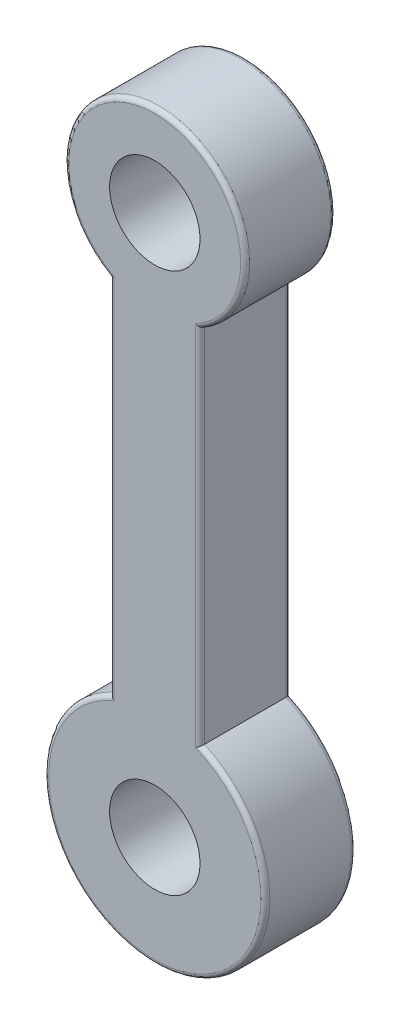
ISO-10303-21;
HEADER;
FILE_DESCRIPTION(('STEP AP214'),'2;1');
FILE_NAME('part.step','',(''),(''),'','','');
FILE_SCHEMA(('AUTOMOTIVE_DESIGN { 1 0 10303 214 1 1 1 1 }'));
ENDSEC;
DATA;
#1=APPLICATION_CONTEXT('core data for automotive mechanical design processes');
#2=APPLICATION_PROTOCOL_DEFINITION('international standard','automotive_design',2000,#1);
#3=PRODUCT_CONTEXT('',#1,'mechanical');
#4=PRODUCT('Part','Part','',(#3));
#5=PRODUCT_RELATED_PRODUCT_CATEGORY('part','',(#4));
#6=PRODUCT_DEFINITION_FORMATION('','',#4);
#7=PRODUCT_DEFINITION_CONTEXT('part definition',#1,'design');
#8=PRODUCT_DEFINITION('design','',#6,#7);
#9=PRODUCT_DEFINITION_SHAPE('','',#8);
#10=(LENGTH_UNIT() NAMED_UNIT(*) SI_UNIT(.MILLI.,.METRE.));
#11=(NAMED_UNIT(*) PLANE_ANGLE_UNIT() SI_UNIT($,.RADIAN.));
#12=(NAMED_UNIT(*) SI_UNIT($,.STERADIAN.) SOLID_ANGLE_UNIT());
#13=UNCERTAINTY_MEASURE_WITH_UNIT(LENGTH_MEASURE(1.E-05),#10,'distance_accuracy_value','');
#14=(GEOMETRIC_REPRESENTATION_CONTEXT(3) GLOBAL_UNCERTAINTY_ASSIGNED_CONTEXT((#13)) GLOBAL_UNIT_ASSIGNED_CONTEXT((#10,
#11,#12)) REPRESENTATION_CONTEXT('',''));
#15=CARTESIAN_POINT('',(0.,0.,0.));
#16=DIRECTION('',(0.,0.,1.));
#17=DIRECTION('',(1.,0.,0.));
#18=AXIS2_PLACEMENT_3D('',#15,#16,#17);
#19=CARTESIAN_POINT('',(0.,0.,20.));
#20=DIRECTION('',(0.,0.,1.));
#21=DIRECTION('',(1.,0.,0.));
#22=AXIS2_PLACEMENT_3D('',#19,#20,#21);
#23=PLANE('',#22);
#24=DIRECTION('',(0.,-1.,0.));
#25=VECTOR('',#24,1.);
#26=CARTESIAN_POINT('',(-9.,-97.3205080756888,20.));
#27=LINE('',#26,#25);
#28=CARTESIAN_POINT('',(-9.,-16.7332005306815,20.));
#29=VERTEX_POINT('',#28);
#30=CARTESIAN_POINT('',(-9.,-97.9779457767185,20.));
#31=VERTEX_POINT('',#30);
#32=EDGE_CURVE('E132',#29,#31,#27,.T.);
#33=ORIENTED_EDGE('',*,*,#32,.T.);
#34=CARTESIAN_POINT('',(0.,-119.641016151378,20.));
#35=DIRECTION('',(0.,0.,1.));
#36=DIRECTION('',(1.,0.,0.));
#37=AXIS2_PLACEMENT_3D('',#34,#35,#36);
#38=CIRCLE('',#37,23.4582313497294);
#39=CARTESIAN_POINT('',(9.,-97.9779457767185,20.));
#40=VERTEX_POINT('',#39);
#41=EDGE_CURVE('E113',#31,#40,#38,.T.);
#42=ORIENTED_EDGE('',*,*,#41,.T.);
#43=DIRECTION('',(0.,1.,0.));
#44=VECTOR('',#43,1.);
#45=CARTESIAN_POINT('',(9.,-17.3205080756888,20.));
#46=LINE('',#45,#44);
#47=CARTESIAN_POINT('',(9.,-16.7332005306815,20.));
#48=VERTEX_POINT('',#47);
#49=EDGE_CURVE('E121',#40,#48,#46,.T.);
#50=ORIENTED_EDGE('',*,*,#49,.T.);
#51=CARTESIAN_POINT('',(0.,0.,20.));
#52=DIRECTION('',(0.,0.,1.));
#53=DIRECTION('',(1.,0.,0.));
#54=AXIS2_PLACEMENT_3D('',#51,#52,#53);
#55=CIRCLE('',#54,19.);
#56=EDGE_CURVE('E127',#48,#29,#55,.T.);
#57=ORIENTED_EDGE('',*,*,#56,.T.);
#58=EDGE_LOOP('',(#33,#42,#50,#57));
#59=FACE_BOUND('',#58,.T.);
#60=CARTESIAN_POINT('',(0.,0.,20.));
#61=DIRECTION('',(0.,0.,1.));
#62=DIRECTION('',(1.,0.,0.));
#63=AXIS2_PLACEMENT_3D('',#60,#61,#62);
#64=CIRCLE('',#63,10.);
#65=CARTESIAN_POINT('',(10.,0.,20.));
#66=VERTEX_POINT('',#65);
#67=EDGE_CURVE('E249',#66,#66,#64,.T.);
#68=ORIENTED_EDGE('',*,*,#67,.F.);
#69=EDGE_LOOP('',(#68));
#70=FACE_BOUND('',#69,.T.);
#71=CARTESIAN_POINT('',(0.,-119.641016151378,20.));
#72=DIRECTION('',(0.,0.,1.));
#73=DIRECTION('',(1.,0.,0.));
#74=AXIS2_PLACEMENT_3D('',#71,#72,#73);
#75=CIRCLE('',#74,10.);
#76=CARTESIAN_POINT('',(10.,-119.641016151378,20.));
#77=VERTEX_POINT('',#76);
#78=EDGE_CURVE('E299',#77,#77,#75,.T.);
#79=ORIENTED_EDGE('',*,*,#78,.F.);
#80=EDGE_LOOP('',(#79));
#81=FACE_BOUND('',#80,.T.);
#82=ADVANCED_FACE('F36',(#59,#70,#81),#23,.T.);
#83=CARTESIAN_POINT('',(0.,0.,0.));
#84=DIRECTION('',(0.,0.,1.));
#85=DIRECTION('',(1.,0.,0.));
#86=AXIS2_PLACEMENT_3D('',#83,#84,#85);
#87=PLANE('',#86);
#88=CARTESIAN_POINT('',(0.,0.,0.));
#89=DIRECTION('',(0.,0.,1.));
#90=DIRECTION('',(1.,0.,0.));
#91=AXIS2_PLACEMENT_3D('',#88,#89,#90);
#92=CIRCLE('',#91,19.);
#93=CARTESIAN_POINT('',(-9.,-16.7332005306815,0.));
#94=VERTEX_POINT('',#93);
#95=CARTESIAN_POINT('',(9.,-16.7332005306815,0.));
#96=VERTEX_POINT('',#95);
#97=EDGE_CURVE('E154',#94,#96,#92,.F.);
#98=ORIENTED_EDGE('',*,*,#97,.T.);
#99=DIRECTION('',(0.,1.,0.));
#100=VECTOR('',#99,1.);
#101=CARTESIAN_POINT('',(9.,0.,0.));
#102=LINE('',#101,#100);
#103=CARTESIAN_POINT('',(9.,-97.9779457767185,0.));
#104=VERTEX_POINT('',#103);
#105=EDGE_CURVE('E11',#96,#104,#102,.F.);
#106=ORIENTED_EDGE('',*,*,#105,.T.);
#107=CARTESIAN_POINT('',(0.,-119.641016151378,0.));
#108=DIRECTION('',(0.,0.,1.));
#109=DIRECTION('',(1.,0.,0.));
#110=AXIS2_PLACEMENT_3D('',#107,#108,#109);
#111=CIRCLE('',#110,23.4582313497294);
#112=CARTESIAN_POINT('',(-9.,-97.9779457767185,0.));
#113=VERTEX_POINT('',#112);
#114=EDGE_CURVE('E50',#104,#113,#111,.F.);
#115=ORIENTED_EDGE('',*,*,#114,.T.);
#116=DIRECTION('',(0.,-1.,0.));
#117=VECTOR('',#116,1.);
#118=CARTESIAN_POINT('',(-9.,0.,0.));
#119=LINE('',#118,#117);
#120=EDGE_CURVE('E156',#113,#94,#119,.F.);
#121=ORIENTED_EDGE('',*,*,#120,.T.);
#122=EDGE_LOOP('',(#98,#106,#115,#121));
#123=FACE_BOUND('',#122,.T.);
#124=CARTESIAN_POINT('',(0.,0.,0.));
#125=DIRECTION('',(0.,0.,1.));
#126=DIRECTION('',(1.,0.,0.));
#127=AXIS2_PLACEMENT_3D('',#124,#125,#126);
#128=CIRCLE('',#127,10.);
#129=CARTESIAN_POINT('',(10.,0.,0.));
#130=VERTEX_POINT('',#129);
#131=EDGE_CURVE('E254',#130,#130,#128,.T.);
#132=ORIENTED_EDGE('',*,*,#131,.T.);
#133=EDGE_LOOP('',(#132));
#134=FACE_BOUND('',#133,.T.);
#135=CARTESIAN_POINT('',(0.,-119.641016151378,0.));
#136=DIRECTION('',(0.,0.,1.));
#137=DIRECTION('',(1.,0.,0.));
#138=AXIS2_PLACEMENT_3D('',#135,#136,#137);
#139=CIRCLE('',#138,10.);
#140=CARTESIAN_POINT('',(10.,-119.641016151378,0.));
#141=VERTEX_POINT('',#140);
#142=EDGE_CURVE('E193',#141,#141,#139,.T.);
#143=ORIENTED_EDGE('',*,*,#142,.T.);
#144=EDGE_LOOP('',(#143));
#145=FACE_BOUND('',#144,.T.);
#146=ADVANCED_FACE('F233',(#123,#134,#145),#87,.F.);
#147=CARTESIAN_POINT('',(0.,0.,20.));
#148=DIRECTION('',(0.,0.,-1.));
#149=DIRECTION('',(-1.,0.,0.));
#150=AXIS2_PLACEMENT_3D('',#147,#148,#149);
#151=CYLINDRICAL_SURFACE('',#150,20.);
#152=DIRECTION('',(0.,0.,-1.));
#153=VECTOR('',#152,1.);
#154=CARTESIAN_POINT('',(-10.,-17.3205080756888,20.));
#155=LINE('',#154,#153);
#156=CARTESIAN_POINT('',(-10.,-17.3205080756888,19.));
#157=VERTEX_POINT('',#156);
#158=CARTESIAN_POINT('',(-10.,-17.3205080756888,0.999999999999997));
#159=VERTEX_POINT('',#158);
#160=EDGE_CURVE('E128',#157,#159,#155,.T.);
#161=ORIENTED_EDGE('',*,*,#160,.F.);
#162=CARTESIAN_POINT('',(0.,0.,19.));
#163=DIRECTION('',(0.,0.,1.));
#164=DIRECTION('',(1.,0.,0.));
#165=AXIS2_PLACEMENT_3D('',#162,#163,#164);
#166=CIRCLE('',#165,20.);
#167=CARTESIAN_POINT('',(10.,-17.3205080756888,19.));
#168=VERTEX_POINT('',#167);
#169=EDGE_CURVE('E147',#157,#168,#166,.F.);
#170=ORIENTED_EDGE('',*,*,#169,.T.);
#171=DIRECTION('',(0.,0.,-1.));
#172=VECTOR('',#171,1.);
#173=CARTESIAN_POINT('',(10.,-17.3205080756888,20.));
#174=LINE('',#173,#172);
#175=CARTESIAN_POINT('',(10.,-17.3205080756888,0.999999999999997));
#176=VERTEX_POINT('',#175);
#177=EDGE_CURVE('E244',#168,#176,#174,.T.);
#178=ORIENTED_EDGE('',*,*,#177,.T.);
#179=CARTESIAN_POINT('',(0.,0.,1.));
#180=DIRECTION('',(0.,0.,1.));
#181=DIRECTION('',(1.,0.,0.));
#182=AXIS2_PLACEMENT_3D('',#179,#180,#181);
#183=CIRCLE('',#182,20.);
#184=EDGE_CURVE('E145',#176,#159,#183,.T.);
#185=ORIENTED_EDGE('',*,*,#184,.T.);
#186=EDGE_LOOP('',(#161,#170,#178,#185));
#187=FACE_BOUND('',#186,.T.);
#188=ADVANCED_FACE('F247',(#187),#151,.T.);
#189=CARTESIAN_POINT('',(-10.,-17.3205080756888,20.));
#190=DIRECTION('',(1.,0.,0.));
#191=DIRECTION('',(0.,0.,-1.));
#192=AXIS2_PLACEMENT_3D('',#189,#190,#191);
#193=PLANE('',#192);
#194=DIRECTION('',(0.,0.,-1.));
#195=VECTOR('',#194,1.);
#196=CARTESIAN_POINT('',(-10.,-97.3205080756888,20.));
#197=LINE('',#196,#195);
#198=CARTESIAN_POINT('',(-10.,-97.3205080756888,19.));
#199=VERTEX_POINT('',#198);
#200=CARTESIAN_POINT('',(-10.,-97.3205080756888,0.999999999999997));
#201=VERTEX_POINT('',#200);
#202=EDGE_CURVE('E251',#199,#201,#197,.T.);
#203=ORIENTED_EDGE('',*,*,#202,.F.);
#204=DIRECTION('',(0.,-1.,0.));
#205=VECTOR('',#204,1.);
#206=CARTESIAN_POINT('',(-10.,-17.3205080756888,19.));
#207=LINE('',#206,#205);
#208=EDGE_CURVE('E143',#199,#157,#207,.F.);
#209=ORIENTED_EDGE('',*,*,#208,.T.);
#210=ORIENTED_EDGE('',*,*,#160,.T.);
#211=DIRECTION('',(0.,-1.,0.));
#212=VECTOR('',#211,1.);
#213=CARTESIAN_POINT('',(-10.,-17.3205080756888,1.));
#214=LINE('',#213,#212);
#215=EDGE_CURVE('E141',#159,#201,#214,.T.);
#216=ORIENTED_EDGE('',*,*,#215,.T.);
#217=EDGE_LOOP('',(#203,#209,#210,#216));
#218=FACE_BOUND('',#217,.T.);
#219=ADVANCED_FACE('F267',(#218),#193,.F.);
#220=CARTESIAN_POINT('',(0.,-119.641016151378,20.));
#221=DIRECTION('',(0.,0.,-1.));
#222=DIRECTION('',(-1.,0.,0.));
#223=AXIS2_PLACEMENT_3D('',#220,#221,#222);
#224=CYLINDRICAL_SURFACE('',#223,24.4582313497294);
#225=DIRECTION('',(0.,0.,-1.));
#226=VECTOR('',#225,1.);
#227=CARTESIAN_POINT('',(10.,-97.3205080756888,20.));
#228=LINE('',#227,#226);
#229=CARTESIAN_POINT('',(10.,-97.3205080756888,19.));
#230=VERTEX_POINT('',#229);
#231=CARTESIAN_POINT('',(10.,-97.3205080756888,0.999999999999997));
#232=VERTEX_POINT('',#231);
#233=EDGE_CURVE('E246',#230,#232,#228,.T.);
#234=ORIENTED_EDGE('',*,*,#233,.F.);
#235=CARTESIAN_POINT('',(0.,-119.641016151378,19.));
#236=DIRECTION('',(0.,0.,1.));
#237=DIRECTION('',(1.,0.,0.));
#238=AXIS2_PLACEMENT_3D('',#235,#236,#237);
#239=CIRCLE('',#238,24.4582313497294);
#240=EDGE_CURVE('E115',#230,#199,#239,.F.);
#241=ORIENTED_EDGE('',*,*,#240,.T.);
#242=ORIENTED_EDGE('',*,*,#202,.T.);
#243=CARTESIAN_POINT('',(0.,-119.641016151378,1.));
#244=DIRECTION('',(0.,0.,1.));
#245=DIRECTION('',(1.,0.,0.));
#246=AXIS2_PLACEMENT_3D('',#243,#244,#245);
#247=CIRCLE('',#246,24.4582313497294);
#248=EDGE_CURVE('E134',#201,#232,#247,.T.);
#249=ORIENTED_EDGE('',*,*,#248,.T.);
#250=EDGE_LOOP('',(#234,#241,#242,#249));
#251=FACE_BOUND('',#250,.T.);
#252=ADVANCED_FACE('F266',(#251),#224,.T.);
#253=CARTESIAN_POINT('',(10.,-17.3205080756888,20.));
#254=DIRECTION('',(-1.,0.,0.));
#255=DIRECTION('',(0.,0.,1.));
#256=AXIS2_PLACEMENT_3D('',#253,#254,#255);
#257=PLANE('',#256);
#258=ORIENTED_EDGE('',*,*,#177,.F.);
#259=DIRECTION('',(0.,1.,0.));
#260=VECTOR('',#259,1.);
#261=CARTESIAN_POINT('',(10.,-97.3205080756888,19.));
#262=LINE('',#261,#260);
#263=EDGE_CURVE('E152',#168,#230,#262,.F.);
#264=ORIENTED_EDGE('',*,*,#263,.T.);
#265=ORIENTED_EDGE('',*,*,#233,.T.);
#266=DIRECTION('',(0.,1.,0.));
#267=VECTOR('',#266,1.);
#268=CARTESIAN_POINT('',(10.,-17.3205080756888,1.));
#269=LINE('',#268,#267);
#270=EDGE_CURVE('E149',#232,#176,#269,.T.);
#271=ORIENTED_EDGE('',*,*,#270,.T.);
#272=EDGE_LOOP('',(#258,#264,#265,#271));
#273=FACE_BOUND('',#272,.T.);
#274=ADVANCED_FACE('F243',(#273),#257,.F.);
#275=CARTESIAN_POINT('',(0.,0.,20.));
#276=DIRECTION('',(0.,0.,-1.));
#277=DIRECTION('',(-1.,0.,0.));
#278=AXIS2_PLACEMENT_3D('',#275,#276,#277);
#279=CYLINDRICAL_SURFACE('',#278,10.);
#280=ORIENTED_EDGE('',*,*,#67,.T.);
#281=EDGE_LOOP('',(#280));
#282=FACE_BOUND('',#281,.T.);
#283=ORIENTED_EDGE('',*,*,#131,.F.);
#284=EDGE_LOOP('',(#283));
#285=FACE_BOUND('',#284,.T.);
#286=ADVANCED_FACE('F282',(#282,#285),#279,.F.);
#287=CARTESIAN_POINT('',(0.,-119.641016151378,20.));
#288=DIRECTION('',(0.,0.,-1.));
#289=DIRECTION('',(-1.,0.,0.));
#290=AXIS2_PLACEMENT_3D('',#287,#288,#289);
#291=CYLINDRICAL_SURFACE('',#290,10.);
#292=ORIENTED_EDGE('',*,*,#78,.T.);
#293=EDGE_LOOP('',(#292));
#294=FACE_BOUND('',#293,.T.);
#295=ORIENTED_EDGE('',*,*,#142,.F.);
#296=EDGE_LOOP('',(#295));
#297=FACE_BOUND('',#296,.T.);
#298=ADVANCED_FACE('F289',(#294,#297),#291,.F.);
#299=CARTESIAN_POINT('',(0.,0.,19.));
#300=DIRECTION('',(0.,0.,1.));
#301=DIRECTION('',(1.,0.,0.));
#302=AXIS2_PLACEMENT_3D('',#299,#300,#301);
#303=TOROIDAL_SURFACE('',#302,19.,1.);
#304=CARTESIAN_POINT('',(10.,-17.3205080756888,19.));
#305=CARTESIAN_POINT('',(10.0000015213787,-17.3205088649879,19.0254213694073));
#306=CARTESIAN_POINT('',(9.9990298908973,-17.3199479917732,19.0508294576426));
#307=CARTESIAN_POINT('',(9.99516504436778,-17.3177164417791,19.1014418799058));
#308=CARTESIAN_POINT('',(9.99227245124936,-17.3160461247702,19.1266462773057));
#309=CARTESIAN_POINT('',(9.98078809503932,-17.3094131179025,19.2014605330454));
#310=CARTESIAN_POINT('',(9.96938918157886,-17.3028280552472,19.2505313542434));
#311=CARTESIAN_POINT('',(9.93967240320598,-17.2856449291653,19.3456933166742));
#312=CARTESIAN_POINT('',(9.92136026994311,-17.2750501900846,19.391786889327));
#313=CARTESIAN_POINT('',(9.87861920031722,-17.2502909209951,19.480035288383));
#314=CARTESIAN_POINT('',(9.85418534373633,-17.2361235194671,19.5221869089135));
#315=CARTESIAN_POINT('',(9.79876970962982,-17.2039433022038,19.6037551827543));
#316=CARTESIAN_POINT('',(9.76751932861995,-17.1857722779364,19.6429258012997));
#317=CARTESIAN_POINT('',(9.70039220690246,-17.1466680871438,19.7154687382402));
#318=CARTESIAN_POINT('',(9.66451432931181,-17.1257342418196,19.7488396270128));
#319=CARTESIAN_POINT('',(9.58435755500454,-17.0788689993086,19.8133244345145));
#320=CARTESIAN_POINT('',(9.53959033522715,-17.0526405245776,19.8436145075656));
#321=CARTESIAN_POINT('',(9.44673922114586,-16.9981037001412,19.8962573307227));
#322=CARTESIAN_POINT('',(9.39865179544903,-16.9697931337577,19.9186014692109));
#323=CARTESIAN_POINT('',(9.2939250511975,-16.9079737334143,19.9576672613025));
#324=CARTESIAN_POINT('',(9.23698803401073,-16.8742683233141,19.9732764258468));
#325=CARTESIAN_POINT('',(9.12192232680775,-16.8059397288755,19.9942558815965));
#326=CARTESIAN_POINT('',(9.0637963634934,-16.7713186005823,19.999647414163));
#327=CARTESIAN_POINT('',(9.00385664538732,-16.7355051991757,19.9999944308194));
#328=CARTESIAN_POINT('',(9.00192824516759,-16.7343528787191,20.0000000085153));
#329=CARTESIAN_POINT('',(9.,-16.7332005306815,20.));
#330=B_SPLINE_CURVE_WITH_KNOTS('',3,(#304,#305,#306,#307,#308,#309,#310,#311,#312,#313,#314,
#315,#316,#317,#318,#319,#320,#321,#322,#323,#324,#325,#326,#327,#328,#329),.UNSPECIFIED.,.F.,
.F.,(4,2,2,2,2,2,2,2,2,2,2,2,4),(0.,0.0762135177415197,0.1524023330285,0.304010944443037,
0.455494134438775,0.607099468929364,0.766370013796125,0.925679763039859,1.10520657890246,
1.28492737298502,1.48807392731624,1.69079769648834,1.69753705604942),.UNSPECIFIED.);
#331=EDGE_CURVE('E124',#168,#48,#330,.T.);
#332=ORIENTED_EDGE('',*,*,#331,.F.);
#333=ORIENTED_EDGE('',*,*,#169,.F.);
#334=CARTESIAN_POINT('',(-10.,-17.3205080756888,19.));
#335=CARTESIAN_POINT('',(-10.0000015213787,-17.3205088649879,19.0254213694073));
#336=CARTESIAN_POINT('',(-9.9990298908973,-17.3199479917732,19.0508294576426));
#337=CARTESIAN_POINT('',(-9.99516504436778,-17.3177164417791,19.1014418799058));
#338=CARTESIAN_POINT('',(-9.99227245124936,-17.3160461247702,19.1266462773057));
#339=CARTESIAN_POINT('',(-9.98078809503932,-17.3094131179025,19.2014605330454));
#340=CARTESIAN_POINT('',(-9.96938918157886,-17.3028280552472,19.2505313542434));
#341=CARTESIAN_POINT('',(-9.93967240320598,-17.2856449291653,19.3456933166742));
#342=CARTESIAN_POINT('',(-9.92136026994311,-17.2750501900846,19.391786889327));
#343=CARTESIAN_POINT('',(-9.87861920031722,-17.2502909209951,19.480035288383));
#344=CARTESIAN_POINT('',(-9.85418534373633,-17.2361235194671,19.5221869089135));
#345=CARTESIAN_POINT('',(-9.79876970962982,-17.2039433022038,19.6037551827543));
#346=CARTESIAN_POINT('',(-9.76751932861995,-17.1857722779364,19.6429258012997));
#347=CARTESIAN_POINT('',(-9.70039220690246,-17.1466680871438,19.7154687382402));
#348=CARTESIAN_POINT('',(-9.66451432931181,-17.1257342418196,19.7488396270128));
#349=CARTESIAN_POINT('',(-9.58435755500454,-17.0788689993086,19.8133244345145));
#350=CARTESIAN_POINT('',(-9.53959033522715,-17.0526405245776,19.8436145075656));
#351=CARTESIAN_POINT('',(-9.44673922114586,-16.9981037001412,19.8962573307227));
#352=CARTESIAN_POINT('',(-9.39865179544903,-16.9697931337577,19.9186014692109));
#353=CARTESIAN_POINT('',(-9.2939250511975,-16.9079737334143,19.9576672613025));
#354=CARTESIAN_POINT('',(-9.23698803401073,-16.8742683233141,19.9732764258468));
#355=CARTESIAN_POINT('',(-9.12192232680775,-16.8059397288755,19.9942558815965));
#356=CARTESIAN_POINT('',(-9.0637963634934,-16.7713186005823,19.999647414163));
#357=CARTESIAN_POINT('',(-9.00385664538732,-16.7355051991757,19.9999944308194));
#358=CARTESIAN_POINT('',(-9.00192824516759,-16.7343528787191,20.0000000085153));
#359=CARTESIAN_POINT('',(-9.,-16.7332005306815,20.));
#360=B_SPLINE_CURVE_WITH_KNOTS('',3,(#334,#335,#336,#337,#338,#339,#340,#341,#342,#343,#344,
#345,#346,#347,#348,#349,#350,#351,#352,#353,#354,#355,#356,#357,#358,#359),.UNSPECIFIED.,.F.,
.F.,(4,2,2,2,2,2,2,2,2,2,2,2,4),(0.,0.0762135177415197,0.1524023330285,0.304010944443037,
0.455494134438775,0.607099468929364,0.766370013796125,0.925679763039859,1.10520657890246,
1.28492737298502,1.48807392731624,1.69079769648834,1.69753705604942),.UNSPECIFIED.);
#361=EDGE_CURVE('E186',#29,#157,#360,.F.);
#362=ORIENTED_EDGE('',*,*,#361,.F.);
#363=ORIENTED_EDGE('',*,*,#56,.F.);
#364=EDGE_LOOP('',(#332,#333,#362,#363));
#365=FACE_BOUND('',#364,.T.);
#366=ADVANCED_FACE('F180',(#365),#303,.T.);
#367=CARTESIAN_POINT('',(-9.,0.,19.));
#368=DIRECTION('',(0.,1.,0.));
#369=DIRECTION('',(0.,0.,1.));
#370=AXIS2_PLACEMENT_3D('',#367,#368,#369);
#371=CYLINDRICAL_SURFACE('',#370,1.);
#372=ORIENTED_EDGE('',*,*,#361,.T.);
#373=ORIENTED_EDGE('',*,*,#208,.F.);
#374=CARTESIAN_POINT('',(-10.,-97.3205080756888,19.));
#375=CARTESIAN_POINT('',(-10.000001799882,-97.3205069901505,19.0248989787468));
#376=CARTESIAN_POINT('',(-9.99906932875468,-97.3211109153625,19.0497846506509));
#377=CARTESIAN_POINT('',(-9.99536255969989,-97.3235121564691,19.0993510007927));
#378=CARTESIAN_POINT('',(-9.99258897458729,-97.3253090105035,19.1240317546246));
#379=CARTESIAN_POINT('',(-9.98158756030443,-97.3324374911229,19.1972482859384));
#380=CARTESIAN_POINT('',(-9.97067837246652,-97.3395074750659,19.2452465898575));
#381=CARTESIAN_POINT('',(-9.9423006680479,-97.3579126125673,19.3382867689851));
#382=CARTESIAN_POINT('',(-9.92483943650304,-97.3692430290977,19.383331862682));
#383=CARTESIAN_POINT('',(-9.88417043991277,-97.3956599245021,19.4695944364561));
#384=CARTESIAN_POINT('',(-9.86095687802403,-97.4107501924065,19.5108079973811));
#385=CARTESIAN_POINT('',(-9.80820187100061,-97.445087061797,19.590970888278));
#386=CARTESIAN_POINT('',(-9.77836837489967,-97.4645260348691,19.6296441312941));
#387=CARTESIAN_POINT('',(-9.71437338393335,-97.5062876544262,19.7014163641255));
#388=CARTESIAN_POINT('',(-9.68021100848484,-97.5286108876474,19.7345142165918));
#389=CARTESIAN_POINT('',(-9.60305227596163,-97.5791149202274,19.7995282074503));
#390=CARTESIAN_POINT('',(-9.55950296480376,-97.6076700000071,19.8304962618502));
#391=CARTESIAN_POINT('',(-9.4691764770102,-97.6670218508032,19.884676795614));
#392=CARTESIAN_POINT('',(-9.42239508009535,-97.6978215557172,19.9078788945732));
#393=CARTESIAN_POINT('',(-9.31507996941294,-97.7686328179898,19.9512306349366));
#394=CARTESIAN_POINT('',(-9.25396781101129,-97.8090635397661,19.969266916028));
#395=CARTESIAN_POINT('',(-9.13034756235593,-97.89108543345,19.993461216682));
#396=CARTESIAN_POINT('',(-9.06784258012373,-97.9326740649525,19.9996434358544));
#397=CARTESIAN_POINT('',(-9.00364940973965,-97.9755102121379,19.9999950105091));
#398=CARTESIAN_POINT('',(-9.00182463514342,-97.9767279890753,20.0000000046921));
#399=CARTESIAN_POINT('',(-9.,-97.9779457767185,20.));
#400=B_SPLINE_CURVE_WITH_KNOTS('',3,(#374,#375,#376,#377,#378,#379,#380,#381,#382,#383,#384,
#385,#386,#387,#388,#389,#390,#391,#392,#393,#394,#395,#396,#397,#398,#399),.UNSPECIFIED.,.F.,
.F.,(4,2,2,2,2,2,2,2,2,2,2,2,4),(0.,0.0746463806174692,0.149263877612203,0.297646167358091,
0.44586396147395,0.594231732124309,0.751333054340354,0.908466385655159,1.08953662851611,
1.27084794222994,1.49623754520769,1.72116653207473,1.72774793907546),.UNSPECIFIED.);
#401=EDGE_CURVE('E118',#31,#199,#400,.F.);
#402=ORIENTED_EDGE('',*,*,#401,.F.);
#403=ORIENTED_EDGE('',*,*,#32,.F.);
#404=EDGE_LOOP('',(#372,#373,#402,#403));
#405=FACE_BOUND('',#404,.T.);
#406=ADVANCED_FACE('F175',(#405),#371,.T.);
#407=CARTESIAN_POINT('',(9.,0.,19.));
#408=DIRECTION('',(0.,-1.,0.));
#409=DIRECTION('',(0.,0.,-1.));
#410=AXIS2_PLACEMENT_3D('',#407,#408,#409);
#411=CYLINDRICAL_SURFACE('',#410,1.);
#412=ORIENTED_EDGE('',*,*,#331,.T.);
#413=ORIENTED_EDGE('',*,*,#49,.F.);
#414=CARTESIAN_POINT('',(10.,-97.3205080756888,19.));
#415=CARTESIAN_POINT('',(10.000001799882,-97.3205069901505,19.0248989787468));
#416=CARTESIAN_POINT('',(9.99906932875468,-97.3211109153625,19.0497846506509));
#417=CARTESIAN_POINT('',(9.99536255969989,-97.3235121564691,19.0993510007927));
#418=CARTESIAN_POINT('',(9.99258897458729,-97.3253090105035,19.1240317546246));
#419=CARTESIAN_POINT('',(9.98158756030443,-97.3324374911229,19.1972482859384));
#420=CARTESIAN_POINT('',(9.97067837246652,-97.3395074750659,19.2452465898575));
#421=CARTESIAN_POINT('',(9.9423006680479,-97.3579126125673,19.3382867689851));
#422=CARTESIAN_POINT('',(9.92483943650304,-97.3692430290977,19.383331862682));
#423=CARTESIAN_POINT('',(9.88417043991277,-97.3956599245021,19.4695944364561));
#424=CARTESIAN_POINT('',(9.86095687802404,-97.4107501924065,19.5108079973811));
#425=CARTESIAN_POINT('',(9.80820187100061,-97.445087061797,19.590970888278));
#426=CARTESIAN_POINT('',(9.77836837489967,-97.4645260348691,19.6296441312941));
#427=CARTESIAN_POINT('',(9.71437338393335,-97.5062876544262,19.7014163641255));
#428=CARTESIAN_POINT('',(9.68021100848484,-97.5286108876474,19.7345142165918));
#429=CARTESIAN_POINT('',(9.60305227596163,-97.5791149202274,19.7995282074503));
#430=CARTESIAN_POINT('',(9.55950296480375,-97.6076700000071,19.8304962618502));
#431=CARTESIAN_POINT('',(9.46917647701019,-97.6670218508032,19.884676795614));
#432=CARTESIAN_POINT('',(9.42239508009534,-97.6978215557172,19.9078788945732));
#433=CARTESIAN_POINT('',(9.31507996941294,-97.7686328179898,19.9512306349366));
#434=CARTESIAN_POINT('',(9.25396781101129,-97.8090635397661,19.969266916028));
#435=CARTESIAN_POINT('',(9.13034756235593,-97.89108543345,19.993461216682));
#436=CARTESIAN_POINT('',(9.06784258012373,-97.9326740649525,19.9996434358544));
#437=CARTESIAN_POINT('',(9.00364940973965,-97.9755102121379,19.9999950105091));
#438=CARTESIAN_POINT('',(9.00182463514342,-97.9767279890753,20.0000000046921));
#439=CARTESIAN_POINT('',(9.,-97.9779457767185,20.));
#440=B_SPLINE_CURVE_WITH_KNOTS('',3,(#414,#415,#416,#417,#418,#419,#420,#421,#422,#423,#424,
#425,#426,#427,#428,#429,#430,#431,#432,#433,#434,#435,#436,#437,#438,#439),.UNSPECIFIED.,.F.,
.F.,(4,2,2,2,2,2,2,2,2,2,2,2,4),(0.,0.0746463806174694,0.149263877612203,0.297646167358092,
0.44586396147395,0.594231732124309,0.75133305434034,0.90846638565516,1.08953662851613,
1.27084794222994,1.49623754520769,1.72116653207474,1.72774793907546),.UNSPECIFIED.);
#441=EDGE_CURVE('E109',#230,#40,#440,.T.);
#442=ORIENTED_EDGE('',*,*,#441,.F.);
#443=ORIENTED_EDGE('',*,*,#263,.F.);
#444=EDGE_LOOP('',(#412,#413,#442,#443));
#445=FACE_BOUND('',#444,.T.);
#446=ADVANCED_FACE('F122',(#445),#411,.T.);
#447=CARTESIAN_POINT('',(0.,-119.641016151378,19.));
#448=DIRECTION('',(0.,0.,1.));
#449=DIRECTION('',(1.,0.,0.));
#450=AXIS2_PLACEMENT_3D('',#447,#448,#449);
#451=TOROIDAL_SURFACE('',#450,23.4582313497294,1.);
#452=ORIENTED_EDGE('',*,*,#401,.T.);
#453=ORIENTED_EDGE('',*,*,#240,.F.);
#454=ORIENTED_EDGE('',*,*,#441,.T.);
#455=ORIENTED_EDGE('',*,*,#41,.F.);
#456=EDGE_LOOP('',(#452,#453,#454,#455));
#457=FACE_BOUND('',#456,.T.);
#458=ADVANCED_FACE('F111',(#457),#451,.T.);
#459=CARTESIAN_POINT('',(-9.,-17.3205080756888,1.));
#460=DIRECTION('',(0.,-1.,0.));
#461=DIRECTION('',(0.,0.,-1.));
#462=AXIS2_PLACEMENT_3D('',#459,#460,#461);
#463=CYLINDRICAL_SURFACE('',#462,1.);
#464=CARTESIAN_POINT('',(-10.,-17.3205080756888,0.999999999999997));
#465=CARTESIAN_POINT('',(-10.0000015213787,-17.3205088649879,0.974578630592668));
#466=CARTESIAN_POINT('',(-9.9990298908973,-17.3199479917732,0.949170542357406));
#467=CARTESIAN_POINT('',(-9.99516504436778,-17.3177164417791,0.898558120094177));
#468=CARTESIAN_POINT('',(-9.99227245124936,-17.3160461247702,0.873353722694295));
#469=CARTESIAN_POINT('',(-9.98078809503932,-17.3094131179025,0.798539466954644));
#470=CARTESIAN_POINT('',(-9.96938918157886,-17.3028280552472,0.749468645756606));
#471=CARTESIAN_POINT('',(-9.93967240320598,-17.2856449291653,0.654306683325831));
#472=CARTESIAN_POINT('',(-9.92136026994311,-17.2750501900846,0.60821311067301));
#473=CARTESIAN_POINT('',(-9.87861920031722,-17.2502909209951,0.519964711616969));
#474=CARTESIAN_POINT('',(-9.85418534373633,-17.2361235194671,0.477813091086526));
#475=CARTESIAN_POINT('',(-9.79876970962982,-17.2039433022038,0.396244817245725));
#476=CARTESIAN_POINT('',(-9.76751932861995,-17.1857722779364,0.357074198700323));
#477=CARTESIAN_POINT('',(-9.70039220690246,-17.1466680871438,0.284531261759825));
#478=CARTESIAN_POINT('',(-9.66451432931181,-17.1257342418196,0.251160372987181));
#479=CARTESIAN_POINT('',(-9.58435755500453,-17.0788689993086,0.186675565485452));
#480=CARTESIAN_POINT('',(-9.53959033522714,-17.0526405245776,0.156385492434427));
#481=CARTESIAN_POINT('',(-9.44673922114586,-16.9981037001412,0.103742669277256));
#482=CARTESIAN_POINT('',(-9.39865179544903,-16.9697931337577,0.0813985307891217));
#483=CARTESIAN_POINT('',(-9.2939250511975,-16.9079737334143,0.0423327386974863));
#484=CARTESIAN_POINT('',(-9.23698803401073,-16.8742683233141,0.0267235741532206));
#485=CARTESIAN_POINT('',(-9.12192232680775,-16.8059397288755,0.00574411840347164));
#486=CARTESIAN_POINT('',(-9.0637963634934,-16.7713186005823,0.000352585836997369));
#487=CARTESIAN_POINT('',(-9.00385664538732,-16.7355051991757,5.56918058794224E-06));
#488=CARTESIAN_POINT('',(-9.00192824516759,-16.7343528787191,-8.51534430952261E-09));
#489=CARTESIAN_POINT('',(-9.,-16.7332005306815,0.));
#490=B_SPLINE_CURVE_WITH_KNOTS('',3,(#464,#465,#466,#467,#468,#469,#470,#471,#472,#473,#474,
#475,#476,#477,#478,#479,#480,#481,#482,#483,#484,#485,#486,#487,#488,#489),.UNSPECIFIED.,.F.,
.F.,(4,2,2,2,2,2,2,2,2,2,2,2,4),(0.,0.0762135177415199,0.152402333028498,0.304010944443036,
0.455494134438775,0.607099468929366,0.766370013796124,0.925679763039861,1.10520657890246,
1.28492737298502,1.48807392731625,1.69079769648834,1.69753705604942),.UNSPECIFIED.);
#491=EDGE_CURVE('E218',#94,#159,#490,.F.);
#492=ORIENTED_EDGE('',*,*,#491,.F.);
#493=ORIENTED_EDGE('',*,*,#120,.F.);
#494=CARTESIAN_POINT('',(-10.,-97.3205080756888,0.999999999999997));
#495=CARTESIAN_POINT('',(-10.000001799882,-97.3205069901505,0.975101021253209));
#496=CARTESIAN_POINT('',(-9.99906932875468,-97.3211109153625,0.950215349349134));
#497=CARTESIAN_POINT('',(-9.99536255969989,-97.3235121564691,0.900648999207316));
#498=CARTESIAN_POINT('',(-9.99258897458729,-97.3253090105035,0.875968245375389));
#499=CARTESIAN_POINT('',(-9.98158756030443,-97.3324374911229,0.802751714061625));
#500=CARTESIAN_POINT('',(-9.97067837246652,-97.3395074750659,0.754753410142455));
#501=CARTESIAN_POINT('',(-9.9423006680479,-97.3579126125673,0.661713231014863));
#502=CARTESIAN_POINT('',(-9.92483943650304,-97.3692430290977,0.616668137317951));
#503=CARTESIAN_POINT('',(-9.88417043991277,-97.3956599245021,0.530405563543867));
#504=CARTESIAN_POINT('',(-9.86095687802403,-97.4107501924065,0.489192002618906));
#505=CARTESIAN_POINT('',(-9.80820187100061,-97.445087061797,0.409029111722033));
#506=CARTESIAN_POINT('',(-9.77836837489967,-97.4645260348691,0.370355868705919));
#507=CARTESIAN_POINT('',(-9.71437338393335,-97.5062876544262,0.29858363587446));
#508=CARTESIAN_POINT('',(-9.68021100848484,-97.5286108876474,0.265485783408169));
#509=CARTESIAN_POINT('',(-9.60305227596163,-97.5791149202274,0.200471792549681));
#510=CARTESIAN_POINT('',(-9.55950296480376,-97.6076700000071,0.169503738149818));
#511=CARTESIAN_POINT('',(-9.4691764770102,-97.6670218508032,0.11532320438602));
#512=CARTESIAN_POINT('',(-9.42239508009534,-97.6978215557172,0.0921211054267772));
#513=CARTESIAN_POINT('',(-9.31507996941294,-97.7686328179898,0.0487693650634082));
#514=CARTESIAN_POINT('',(-9.25396781101129,-97.8090635397661,0.0307330839720473));
#515=CARTESIAN_POINT('',(-9.13034756235593,-97.89108543345,0.00653878331802709));
#516=CARTESIAN_POINT('',(-9.06784258012373,-97.9326740649525,0.000356564145597963));
#517=CARTESIAN_POINT('',(-9.00364940973965,-97.9755102121379,4.9894909085615E-06));
#518=CARTESIAN_POINT('',(-9.00182463514342,-97.9767279890753,-4.6920683105239E-09));
#519=CARTESIAN_POINT('',(-9.,-97.9779457767185,0.));
#520=B_SPLINE_CURVE_WITH_KNOTS('',3,(#494,#495,#496,#497,#498,#499,#500,#501,#502,#503,#504,
#505,#506,#507,#508,#509,#510,#511,#512,#513,#514,#515,#516,#517,#518,#519),.UNSPECIFIED.,.F.,
.F.,(4,2,2,2,2,2,2,2,2,2,2,2,4),(0.,0.0746463806174686,0.149263877612202,0.297646167358093,
0.445863961473951,0.594231732124308,0.751333054340338,0.908466385655164,1.08953662851612,
1.27084794222994,1.49623754520769,1.72116653207473,1.72774793907546),.UNSPECIFIED.);
#521=EDGE_CURVE('E41',#201,#113,#520,.T.);
#522=ORIENTED_EDGE('',*,*,#521,.F.);
#523=ORIENTED_EDGE('',*,*,#215,.F.);
#524=EDGE_LOOP('',(#492,#493,#522,#523));
#525=FACE_BOUND('',#524,.T.);
#526=ADVANCED_FACE('F38',(#525),#463,.T.);
#527=CARTESIAN_POINT('',(0.,-119.641016151378,1.));
#528=DIRECTION('',(0.,0.,1.));
#529=DIRECTION('',(1.,0.,0.));
#530=AXIS2_PLACEMENT_3D('',#527,#528,#529);
#531=TOROIDAL_SURFACE('',#530,23.4582313497294,1.);
#532=ORIENTED_EDGE('',*,*,#521,.T.);
#533=ORIENTED_EDGE('',*,*,#114,.F.);
#534=CARTESIAN_POINT('',(10.,-97.3205080756888,0.999999999999997));
#535=CARTESIAN_POINT('',(10.000001799882,-97.3205069901505,0.975101021253209));
#536=CARTESIAN_POINT('',(9.99906932875468,-97.3211109153625,0.950215349349134));
#537=CARTESIAN_POINT('',(9.99536255969989,-97.3235121564691,0.900648999207316));
#538=CARTESIAN_POINT('',(9.99258897458729,-97.3253090105035,0.87596824537539));
#539=CARTESIAN_POINT('',(9.98158756030443,-97.3324374911229,0.802751714061625));
#540=CARTESIAN_POINT('',(9.97067837246652,-97.3395074750659,0.754753410142455));
#541=CARTESIAN_POINT('',(9.9423006680479,-97.3579126125673,0.661713231014863));
#542=CARTESIAN_POINT('',(9.92483943650304,-97.3692430290977,0.616668137317951));
#543=CARTESIAN_POINT('',(9.88417043991277,-97.3956599245021,0.530405563543866));
#544=CARTESIAN_POINT('',(9.86095687802403,-97.4107501924065,0.489192002618906));
#545=CARTESIAN_POINT('',(9.80820187100061,-97.445087061797,0.409029111722032));
#546=CARTESIAN_POINT('',(9.77836837489967,-97.4645260348691,0.370355868705919));
#547=CARTESIAN_POINT('',(9.71437338393335,-97.5062876544262,0.29858363587446));
#548=CARTESIAN_POINT('',(9.68021100848484,-97.5286108876474,0.265485783408169));
#549=CARTESIAN_POINT('',(9.60305227596163,-97.5791149202274,0.200471792549683));
#550=CARTESIAN_POINT('',(9.55950296480376,-97.6076700000071,0.169503738149822));
#551=CARTESIAN_POINT('',(9.4691764770102,-97.6670218508032,0.115323204386023));
#552=CARTESIAN_POINT('',(9.42239508009535,-97.6978215557172,0.0921211054267785));
#553=CARTESIAN_POINT('',(9.31507996941294,-97.7686328179898,0.0487693650634088));
#554=CARTESIAN_POINT('',(9.25396781101129,-97.8090635397661,0.0307330839720474));
#555=CARTESIAN_POINT('',(9.13034756235593,-97.89108543345,0.00653878331802694));
#556=CARTESIAN_POINT('',(9.06784258012373,-97.9326740649525,0.000356564145598117));
#557=CARTESIAN_POINT('',(9.00364940973965,-97.9755102121379,4.98949090857093E-06));
#558=CARTESIAN_POINT('',(9.00182463514342,-97.9767279890753,-4.69206830560623E-09));
#559=CARTESIAN_POINT('',(9.,-97.9779457767185,0.));
#560=B_SPLINE_CURVE_WITH_KNOTS('',3,(#534,#535,#536,#537,#538,#539,#540,#541,#542,#543,#544,
#545,#546,#547,#548,#549,#550,#551,#552,#553,#554,#555,#556,#557,#558,#559),.UNSPECIFIED.,.F.,
.F.,(4,2,2,2,2,2,2,2,2,2,2,2,4),(0.,0.0746463806174685,0.149263877612202,0.297646167358093,
0.445863961473951,0.594231732124308,0.751333054340339,0.908466385655165,1.0895366285161,
1.27084794222994,1.49623754520769,1.72116653207473,1.72774793907546),.UNSPECIFIED.);
#561=EDGE_CURVE('E58',#232,#104,#560,.T.);
#562=ORIENTED_EDGE('',*,*,#561,.F.);
#563=ORIENTED_EDGE('',*,*,#248,.F.);
#564=EDGE_LOOP('',(#532,#533,#562,#563));
#565=FACE_BOUND('',#564,.T.);
#566=ADVANCED_FACE('F214',(#565),#531,.T.);
#567=CARTESIAN_POINT('',(0.,0.,1.));
#568=DIRECTION('',(0.,0.,1.));
#569=DIRECTION('',(1.,0.,0.));
#570=AXIS2_PLACEMENT_3D('',#567,#568,#569);
#571=TOROIDAL_SURFACE('',#570,19.,1.);
#572=ORIENTED_EDGE('',*,*,#491,.T.);
#573=ORIENTED_EDGE('',*,*,#184,.F.);
#574=CARTESIAN_POINT('',(10.,-17.3205080756888,0.999999999999997));
#575=CARTESIAN_POINT('',(10.0000015213787,-17.3205088649879,0.974578630592668));
#576=CARTESIAN_POINT('',(9.9990298908973,-17.3199479917732,0.949170542357406));
#577=CARTESIAN_POINT('',(9.99516504436778,-17.3177164417791,0.898558120094177));
#578=CARTESIAN_POINT('',(9.99227245124936,-17.3160461247702,0.873353722694295));
#579=CARTESIAN_POINT('',(9.98078809503932,-17.3094131179025,0.798539466954644));
#580=CARTESIAN_POINT('',(9.96938918157886,-17.3028280552472,0.749468645756606));
#581=CARTESIAN_POINT('',(9.93967240320598,-17.2856449291653,0.654306683325831));
#582=CARTESIAN_POINT('',(9.92136026994311,-17.2750501900846,0.60821311067301));
#583=CARTESIAN_POINT('',(9.87861920031722,-17.2502909209951,0.519964711616969));
#584=CARTESIAN_POINT('',(9.85418534373633,-17.2361235194671,0.477813091086526));
#585=CARTESIAN_POINT('',(9.79876970962982,-17.2039433022038,0.396244817245725));
#586=CARTESIAN_POINT('',(9.76751932861995,-17.1857722779364,0.357074198700323));
#587=CARTESIAN_POINT('',(9.70039220690246,-17.1466680871438,0.284531261759825));
#588=CARTESIAN_POINT('',(9.66451432931181,-17.1257342418196,0.251160372987181));
#589=CARTESIAN_POINT('',(9.58435755500453,-17.0788689993086,0.186675565485452));
#590=CARTESIAN_POINT('',(9.53959033522714,-17.0526405245776,0.156385492434427));
#591=CARTESIAN_POINT('',(9.44673922114586,-16.9981037001412,0.103742669277256));
#592=CARTESIAN_POINT('',(9.39865179544903,-16.9697931337577,0.0813985307891217));
#593=CARTESIAN_POINT('',(9.2939250511975,-16.9079737334143,0.0423327386974863));
#594=CARTESIAN_POINT('',(9.23698803401073,-16.8742683233141,0.0267235741532206));
#595=CARTESIAN_POINT('',(9.12192232680775,-16.8059397288755,0.00574411840347164));
#596=CARTESIAN_POINT('',(9.0637963634934,-16.7713186005823,0.000352585836997369));
#597=CARTESIAN_POINT('',(9.00385664538732,-16.7355051991757,5.56918058794224E-06));
#598=CARTESIAN_POINT('',(9.00192824516759,-16.7343528787191,-8.51534430952261E-09));
#599=CARTESIAN_POINT('',(9.,-16.7332005306815,0.));
#600=B_SPLINE_CURVE_WITH_KNOTS('',3,(#574,#575,#576,#577,#578,#579,#580,#581,#582,#583,#584,
#585,#586,#587,#588,#589,#590,#591,#592,#593,#594,#595,#596,#597,#598,#599),.UNSPECIFIED.,.F.,
.F.,(4,2,2,2,2,2,2,2,2,2,2,2,4),(0.,0.0762135177415199,0.152402333028498,0.304010944443036,
0.455494134438775,0.607099468929366,0.766370013796124,0.925679763039861,1.10520657890246,
1.28492737298502,1.48807392731625,1.69079769648834,1.69753705604942),.UNSPECIFIED.);
#601=EDGE_CURVE('E198',#96,#176,#600,.F.);
#602=ORIENTED_EDGE('',*,*,#601,.F.);
#603=ORIENTED_EDGE('',*,*,#97,.F.);
#604=EDGE_LOOP('',(#572,#573,#602,#603));
#605=FACE_BOUND('',#604,.T.);
#606=ADVANCED_FACE('F211',(#605),#571,.T.);
#607=CARTESIAN_POINT('',(9.,-17.3205080756888,1.));
#608=DIRECTION('',(0.,1.,0.));
#609=DIRECTION('',(0.,0.,1.));
#610=AXIS2_PLACEMENT_3D('',#607,#608,#609);
#611=CYLINDRICAL_SURFACE('',#610,1.);
#612=ORIENTED_EDGE('',*,*,#561,.T.);
#613=ORIENTED_EDGE('',*,*,#105,.F.);
#614=ORIENTED_EDGE('',*,*,#601,.T.);
#615=ORIENTED_EDGE('',*,*,#270,.F.);
#616=EDGE_LOOP('',(#612,#613,#614,#615));
#617=FACE_BOUND('',#616,.T.);
#618=ADVANCED_FACE('F209',(#617),#611,.T.);
#619=CLOSED_SHELL('',(#82,#146,#188,#219,#252,#274,#286,#298,#366,#406,#446,#458,#526,#566,#606,#618));
#620=MANIFOLD_SOLID_BREP('B2',#619);
#621=ADVANCED_BREP_SHAPE_REPRESENTATION('',(#18,#620),#14);
#622=SHAPE_DEFINITION_REPRESENTATION(#9,#621);
ENDSEC;
END-ISO-10303-21;
